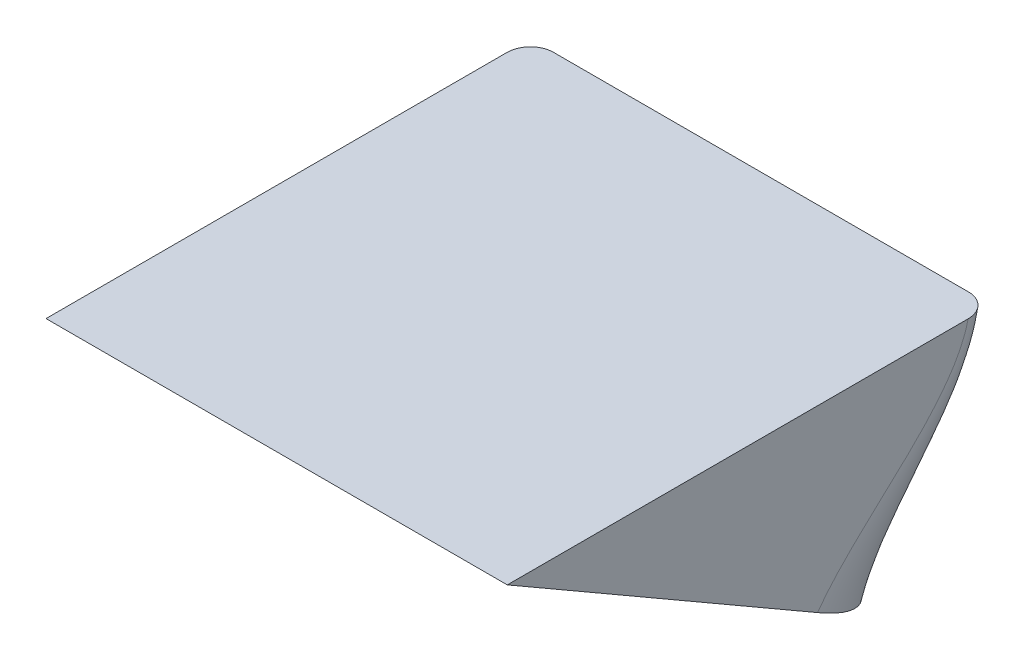
ISO-10303-21;
HEADER;
FILE_DESCRIPTION(('STEP AP214'),'2;1');
FILE_NAME('part.step','',(''),(''),'','','');
FILE_SCHEMA(('AUTOMOTIVE_DESIGN { 1 0 10303 214 1 1 1 1 }'));
ENDSEC;
DATA;
#1=APPLICATION_CONTEXT('core data for automotive mechanical design processes');
#2=APPLICATION_PROTOCOL_DEFINITION('international standard','automotive_design',2000,#1);
#3=PRODUCT_CONTEXT('',#1,'mechanical');
#4=PRODUCT('Part','Part','',(#3));
#5=PRODUCT_RELATED_PRODUCT_CATEGORY('part','',(#4));
#6=PRODUCT_DEFINITION_FORMATION('','',#4);
#7=PRODUCT_DEFINITION_CONTEXT('part definition',#1,'design');
#8=PRODUCT_DEFINITION('design','',#6,#7);
#9=PRODUCT_DEFINITION_SHAPE('','',#8);
#10=(LENGTH_UNIT() NAMED_UNIT(*) SI_UNIT(.MILLI.,.METRE.));
#11=(NAMED_UNIT(*) PLANE_ANGLE_UNIT() SI_UNIT($,.RADIAN.));
#12=(NAMED_UNIT(*) SI_UNIT($,.STERADIAN.) SOLID_ANGLE_UNIT());
#13=UNCERTAINTY_MEASURE_WITH_UNIT(LENGTH_MEASURE(1.E-05),#10,'distance_accuracy_value','');
#14=(GEOMETRIC_REPRESENTATION_CONTEXT(3) GLOBAL_UNCERTAINTY_ASSIGNED_CONTEXT((#13)) GLOBAL_UNIT_ASSIGNED_CONTEXT((#10,
#11,#12)) REPRESENTATION_CONTEXT('',''));
#15=CARTESIAN_POINT('',(0.,0.,0.));
#16=DIRECTION('',(0.,0.,1.));
#17=DIRECTION('',(1.,0.,0.));
#18=AXIS2_PLACEMENT_3D('',#15,#16,#17);
#19=CARTESIAN_POINT('',(-30.,-66.,-31.5));
#20=DIRECTION('',(0.,1.,0.));
#21=DIRECTION('',(0.,0.,1.));
#22=AXIS2_PLACEMENT_3D('',#19,#20,#21);
#23=PLANE('',#22);
#24=DIRECTION('',(1.,0.,0.));
#25=VECTOR('',#24,1.);
#26=CARTESIAN_POINT('',(0.,-66.,-31.5));
#27=LINE('',#26,#25);
#28=CARTESIAN_POINT('',(-27.,-66.,-31.5));
#29=VERTEX_POINT('',#28);
#30=CARTESIAN_POINT('',(27.,-66.,-31.5));
#31=VERTEX_POINT('',#30);
#32=EDGE_CURVE('E183',#29,#31,#27,.T.);
#33=ORIENTED_EDGE('',*,*,#32,.F.);
#34=CARTESIAN_POINT('',(-27.,-66.,-31.5));
#35=CARTESIAN_POINT('',(-27.083409750939,-66.,-31.5000087998473));
#36=CARTESIAN_POINT('',(-27.1668152959624,-66.,-31.4964677986083));
#37=CARTESIAN_POINT('',(-27.333023273883,-66.,-31.4823543059817));
#38=CARTESIAN_POINT('',(-27.4158257515633,-66.,-31.4717823421999));
#39=CARTESIAN_POINT('',(-27.5801533988719,-66.,-31.4436907770837));
#40=CARTESIAN_POINT('',(-27.6616798967303,-66.,-31.4261789800236));
#41=CARTESIAN_POINT('',(-27.8229468520137,-66.,-31.3843598908501));
#42=CARTESIAN_POINT('',(-27.9026873216265,-66.,-31.3600526451244));
#43=CARTESIAN_POINT('',(-28.1384417452151,-66.,-31.2771603859736));
#44=CARTESIAN_POINT('',(-28.2910783274851,-66.,-31.2085894223591));
#45=CARTESIAN_POINT('',(-28.5826621893436,-66.,-31.0469780269951));
#46=CARTESIAN_POINT('',(-28.7216104067731,-66.,-30.9539392732304));
#47=CARTESIAN_POINT('',(-28.982920650389,-66.,-30.7455025844542));
#48=CARTESIAN_POINT('',(-29.1051824382591,-66.,-30.629978839817));
#49=CARTESIAN_POINT('',(-29.3289012549432,-66.,-30.3802792218854));
#50=CARTESIAN_POINT('',(-29.4303547812059,-66.,-30.2461002148109));
#51=CARTESIAN_POINT('',(-29.6111198881664,-66.,-29.9609565623901));
#52=CARTESIAN_POINT('',(-29.6901030535738,-66.,-29.8097839775815));
#53=CARTESIAN_POINT('',(-29.8220827422039,-66.,-29.496502144927));
#54=CARTESIAN_POINT('',(-29.8750847572,-65.9999999999999,-29.3343952165797));
#55=CARTESIAN_POINT('',(-29.942979581329,-65.9999999999999,-29.0498725213845));
#56=CARTESIAN_POINT('',(-29.9643723849996,-66.,-28.9289616645253));
#57=CARTESIAN_POINT('',(-29.9928821201246,-66.,-28.6856615836717));
#58=CARTESIAN_POINT('',(-30.0000216359405,-66.,-28.5632750080659));
#59=CARTESIAN_POINT('',(-30.,-66.,-28.4408525525516));
#60=B_SPLINE_CURVE_WITH_KNOTS('',3,(#34,#35,#36,#37,#38,#39,#40,#41,#42,#43,#44,#45,#46,#47,#48,
#49,#50,#51,#52,#53,#54,#55,#56,#57,#58,#59),.UNSPECIFIED.,.F.,.F.,(4,2,2,2,2,2,2,2,2,2,2,2,4),
(0.,0.250146634642803,0.50027450032079,0.750121876243957,0.999967546684958,1.49938952813993,
1.99877726849431,2.50104400520802,3.00339521672346,3.51275004413754,4.02199716004835,
4.38956480665742,4.75654957791437),.UNSPECIFIED.);
#61=CARTESIAN_POINT('',(-30.,-66.,-28.4408525525516));
#62=VERTEX_POINT('',#61);
#63=EDGE_CURVE('E203',#29,#62,#60,.T.);
#64=ORIENTED_EDGE('',*,*,#63,.T.);
#65=DIRECTION('',(0.,0.,1.));
#66=VECTOR('',#65,1.);
#67=CARTESIAN_POINT('',(-30.,-66.,-31.5));
#68=LINE('',#67,#66);
#69=CARTESIAN_POINT('',(-30.,-66.,31.5));
#70=VERTEX_POINT('',#69);
#71=EDGE_CURVE('E172',#62,#70,#68,.T.);
#72=ORIENTED_EDGE('',*,*,#71,.T.);
#73=DIRECTION('',(1.,0.,0.));
#74=VECTOR('',#73,1.);
#75=CARTESIAN_POINT('',(0.,-66.,31.5));
#76=LINE('',#75,#74);
#77=CARTESIAN_POINT('',(30.,-66.,31.5));
#78=VERTEX_POINT('',#77);
#79=EDGE_CURVE('E186',#70,#78,#76,.T.);
#80=ORIENTED_EDGE('',*,*,#79,.T.);
#81=DIRECTION('',(0.,0.,1.));
#82=VECTOR('',#81,1.);
#83=CARTESIAN_POINT('',(30.,-66.,-31.5));
#84=LINE('',#83,#82);
#85=CARTESIAN_POINT('',(30.,-66.,-28.4408525525511));
#86=VERTEX_POINT('',#85);
#87=EDGE_CURVE('E165',#86,#78,#84,.T.);
#88=ORIENTED_EDGE('',*,*,#87,.F.);
#89=CARTESIAN_POINT('',(30.,-66.000000000002,-28.4408525525511));
#90=CARTESIAN_POINT('',(30.000007531813,-66.0000000000007,-28.5283329955902));
#91=CARTESIAN_POINT('',(29.9963660977423,-66.0000000000002,-28.615812674946));
#92=CARTESIAN_POINT('',(29.9818111411775,-65.9999999999998,-28.7901696416501));
#93=CARTESIAN_POINT('',(29.9708972042897,-65.9999999999999,-28.8770468943866));
#94=CARTESIAN_POINT('',(29.9418216750174,-66.0000000000001,-29.0495964352772));
#95=CARTESIAN_POINT('',(29.9236593770083,-66.,-29.1352686052762));
#96=CARTESIAN_POINT('',(29.8801963874258,-66.,-29.3047546061911));
#97=CARTESIAN_POINT('',(29.8548959757725,-66.,-29.3885685098398));
#98=CARTESIAN_POINT('',(29.768401708112,-66.,-29.6364870416861));
#99=CARTESIAN_POINT('',(29.6966184081053,-66.,-29.7970471838911));
#100=CARTESIAN_POINT('',(29.5267499427174,-66.,-30.1034033545798));
#101=CARTESIAN_POINT('',(29.428677506337,-66.,-30.2492064813567));
#102=CARTESIAN_POINT('',(29.2105914563231,-66.,-30.5196072659805));
#103=CARTESIAN_POINT('',(29.0909477981821,-66.,-30.6445027774188));
#104=CARTESIAN_POINT('',(28.8320125456285,-66.,-30.8720107041019));
#105=CARTESIAN_POINT('',(28.6927171127211,-66.,-30.9746187560675));
#106=CARTESIAN_POINT('',(28.4011715269257,-66.,-31.1527006852311));
#107=CARTESIAN_POINT('',(28.2491961428452,-66.,-31.2286250933951));
#108=CARTESIAN_POINT('',(27.9345922250912,-66.,-31.3534644322736));
#109=CARTESIAN_POINT('',(27.7719726861893,-66.,-31.4024018467737));
#110=CARTESIAN_POINT('',(27.5067582030237,-66.,-31.4580097597986));
#111=CARTESIAN_POINT('',(27.4059775698433,-66.,-31.4737479245535));
#112=CARTESIAN_POINT('',(27.2034802097448,-66.,-31.4947397788626));
#113=CARTESIAN_POINT('',(27.1017650751468,-66.,-31.5000088337571));
#114=CARTESIAN_POINT('',(27.,-66.0000000000001,-31.5));
#115=B_SPLINE_CURVE_WITH_KNOTS('',3,(#89,#90,#91,#92,#93,#94,#95,#96,#97,#98,#99,#100,#101,#102,
#103,#104,#105,#106,#107,#108,#109,#110,#111,#112,#113,#114),.UNSPECIFIED.,.F.,.F.,(4,2,2,2,2,2,
2,2,2,2,2,2,4),(0.,0.26236310731463,0.524741165590485,0.787144772478248,1.04953809067369,
1.57438872597411,2.09898569017098,2.61531912343855,3.13175354984066,3.63899427800126,
4.14581176566762,4.45132173797554,4.75638298613195),.UNSPECIFIED.);
#116=EDGE_CURVE('E11',#86,#31,#115,.T.);
#117=ORIENTED_EDGE('',*,*,#116,.T.);
#118=EDGE_LOOP('',(#33,#64,#72,#80,#88,#117));
#119=FACE_BOUND('',#118,.T.);
#120=ADVANCED_FACE('F44',(#119),#23,.T.);
#121=CARTESIAN_POINT('',(-30.,-66.,-31.5));
#122=DIRECTION('',(0.,-0.173648177666927,-0.984807753012208));
#123=DIRECTION('',(0.,0.984807753012209,-0.173648177666927));
#124=AXIS2_PLACEMENT_3D('',#121,#122,#123);
#125=PLANE('',#124);
#126=DIRECTION('',(1.,0.,0.));
#127=VECTOR('',#126,1.);
#128=CARTESIAN_POINT('',(-30.,-99.0123314089026,-25.6790352765211));
#129=LINE('',#128,#127);
#130=CARTESIAN_POINT('',(-10.,-99.0123314089026,-25.6790352765211));
#131=VERTEX_POINT('',#130);
#132=CARTESIAN_POINT('',(9.99999999999999,-99.0123314089026,-25.6790352765211));
#133=VERTEX_POINT('',#132);
#134=EDGE_CURVE('E180',#131,#133,#129,.T.);
#135=ORIENTED_EDGE('',*,*,#134,.F.);
#136=CARTESIAN_POINT('',(-10.,-165.036994226708,-14.0371058295632));
#137=CARTESIAN_POINT('',(-10.,-143.02877328744,-17.9177489785492));
#138=CARTESIAN_POINT('',(-10.,-121.020552348171,-21.7983921275351));
#139=CARTESIAN_POINT('',(-10.,-99.0123314089027,-25.6790352765211));
#140=CARTESIAN_POINT('',(-10.,-88.0082209392685,-27.6193568510141));
#141=CARTESIAN_POINT('',(-27.,-77.0041104696343,-29.559678425507));
#142=CARTESIAN_POINT('',(-27.,-66.,-31.5));
#143=CARTESIAN_POINT('',(-27.,-43.9917790607316,-35.380643148986));
#144=CARTESIAN_POINT('',(-27.,-21.9835581214632,-39.2612862979719));
#145=CARTESIAN_POINT('',(-27.,0.0246628178052766,-43.1419294469578));
#146=(BOUNDED_CURVE() B_SPLINE_CURVE(3,(#136,#137,#138,#139,#140,#141,#142,#143,#144,#145),
.UNSPECIFIED.,.F.,.F.) B_SPLINE_CURVE_WITH_KNOTS((4,3,3,4),(-0.100564799498974,
-0.0335215998329913,0.,0.0670431996659827),
.UNSPECIFIED.) CURVE() GEOMETRIC_REPRESENTATION_ITEM() RATIONAL_B_SPLINE_CURVE((1.,1.,1.,1.,1.,
1.,1.,1.,1.,1.)) REPRESENTATION_ITEM(''));
#147=EDGE_CURVE('E194',#131,#29,#146,.T.);
#148=ORIENTED_EDGE('',*,*,#147,.T.);
#149=ORIENTED_EDGE('',*,*,#32,.T.);
#150=CARTESIAN_POINT('',(10.,-165.036994226708,-14.0371058295632));
#151=CARTESIAN_POINT('',(10.,-143.02877328744,-17.9177489785492));
#152=CARTESIAN_POINT('',(10.,-121.020552348171,-21.7983921275351));
#153=CARTESIAN_POINT('',(10.,-99.0123314089027,-25.6790352765211));
#154=CARTESIAN_POINT('',(10.,-88.0082209392685,-27.6193568510141));
#155=CARTESIAN_POINT('',(27.,-77.0041104696343,-29.559678425507));
#156=CARTESIAN_POINT('',(27.,-66.,-31.5));
#157=CARTESIAN_POINT('',(27.,-43.9917790607316,-35.380643148986));
#158=CARTESIAN_POINT('',(27.,-21.9835581214632,-39.2612862979719));
#159=CARTESIAN_POINT('',(27.,0.0246628178052766,-43.1419294469578));
#160=(BOUNDED_CURVE() B_SPLINE_CURVE(3,(#150,#151,#152,#153,#154,#155,#156,#157,#158,#159),
.UNSPECIFIED.,.F.,.F.) B_SPLINE_CURVE_WITH_KNOTS((4,3,3,4),(-0.100564799498974,
-0.0335215998329913,0.,0.0670431996659827),
.UNSPECIFIED.) CURVE() GEOMETRIC_REPRESENTATION_ITEM() RATIONAL_B_SPLINE_CURVE((1.,1.,1.,1.,1.,
1.,1.,1.,1.,1.)) REPRESENTATION_ITEM(''));
#161=EDGE_CURVE('E189',#31,#133,#160,.F.);
#162=ORIENTED_EDGE('',*,*,#161,.T.);
#163=EDGE_LOOP('',(#135,#148,#149,#162));
#164=FACE_BOUND('',#163,.T.);
#165=ADVANCED_FACE('F229',(#164),#125,.T.);
#166=CARTESIAN_POINT('',(-30.,-99.0123314089026,-25.6790352765211));
#167=DIRECTION('',(0.,-0.866025403784438,0.500000000000001));
#168=DIRECTION('',(0.,-0.500000000000001,-0.866025403784438));
#169=AXIS2_PLACEMENT_3D('',#166,#167,#168);
#170=PLANE('',#169);
#171=CARTESIAN_POINT('',(0.,-88.5000000000001,-7.47114317029971));
#172=DIRECTION('',(0.,-0.866025403784438,0.500000000000001));
#173=DIRECTION('',(0.,-0.500000000000001,-0.866025403784438));
#174=AXIS2_PLACEMENT_3D('',#171,#172,#173);
#175=CIRCLE('',#174,2.5);
#176=CARTESIAN_POINT('',(0.,-89.7500000000001,-9.63620667976081));
#177=VERTEX_POINT('',#176);
#178=EDGE_CURVE('E128',#177,#177,#175,.T.);
#179=ORIENTED_EDGE('',*,*,#178,.F.);
#180=EDGE_LOOP('',(#179));
#181=FACE_BOUND('',#180,.T.);
#182=CARTESIAN_POINT('',(-20.,-93.5000000000001,-16.1313972081441));
#183=DIRECTION('',(0.,-0.866025403784438,0.500000000000001));
#184=DIRECTION('',(0.,-0.500000000000001,-0.866025403784438));
#185=AXIS2_PLACEMENT_3D('',#182,#183,#184);
#186=CIRCLE('',#185,2.5);
#187=CARTESIAN_POINT('',(-20.,-94.7500000000001,-18.2964607176052));
#188=VERTEX_POINT('',#187);
#189=EDGE_CURVE('E127',#188,#188,#186,.T.);
#190=ORIENTED_EDGE('',*,*,#189,.F.);
#191=EDGE_LOOP('',(#190));
#192=FACE_BOUND('',#191,.T.);
#193=CARTESIAN_POINT('',(20.,-83.5000000000001,1.18911086754467));
#194=DIRECTION('',(0.,-0.866025403784438,0.500000000000001));
#195=DIRECTION('',(0.,-0.500000000000001,-0.866025403784438));
#196=AXIS2_PLACEMENT_3D('',#193,#194,#195);
#197=CIRCLE('',#196,2.5);
#198=CARTESIAN_POINT('',(20.,-84.7500000000001,-0.975952641916426));
#199=VERTEX_POINT('',#198);
#200=EDGE_CURVE('E141',#199,#199,#197,.T.);
#201=ORIENTED_EDGE('',*,*,#200,.F.);
#202=EDGE_LOOP('',(#201));
#203=FACE_BOUND('',#202,.T.);
#204=CARTESIAN_POINT('',(20.,-93.5000000000001,-16.1313972081441));
#205=DIRECTION('',(0.,-0.866025403784438,0.500000000000001));
#206=DIRECTION('',(0.,-0.500000000000001,-0.866025403784438));
#207=AXIS2_PLACEMENT_3D('',#204,#205,#206);
#208=CIRCLE('',#207,2.5);
#209=CARTESIAN_POINT('',(20.,-94.7500000000001,-18.2964607176052));
#210=VERTEX_POINT('',#209);
#211=EDGE_CURVE('E149',#210,#210,#208,.T.);
#212=ORIENTED_EDGE('',*,*,#211,.F.);
#213=EDGE_LOOP('',(#212));
#214=FACE_BOUND('',#213,.T.);
#215=CARTESIAN_POINT('',(-20.,-83.5000000000001,1.18911086754467));
#216=DIRECTION('',(0.,-0.866025403784438,0.500000000000001));
#217=DIRECTION('',(0.,-0.500000000000001,-0.866025403784438));
#218=AXIS2_PLACEMENT_3D('',#215,#216,#217);
#219=CIRCLE('',#218,2.5);
#220=CARTESIAN_POINT('',(-20.,-84.7500000000001,-0.975952641916426));
#221=VERTEX_POINT('',#220);
#222=EDGE_CURVE('E157',#221,#221,#219,.T.);
#223=ORIENTED_EDGE('',*,*,#222,.F.);
#224=EDGE_LOOP('',(#223));
#225=FACE_BOUND('',#224,.T.);
#226=DIRECTION('',(0.,-0.500000000000001,-0.866025403784438));
#227=VECTOR('',#226,1.);
#228=CARTESIAN_POINT('',(-30.,-99.0123314089026,-25.6790352765211));
#229=LINE('',#228,#227);
#230=CARTESIAN_POINT('',(-30.,-89.2962735941893,-8.85032949216093));
#231=VERTEX_POINT('',#230);
#232=EDGE_CURVE('E176',#70,#231,#229,.T.);
#233=ORIENTED_EDGE('',*,*,#232,.T.);
#234=CARTESIAN_POINT('',(-30.,-89.2962735941893,-8.85032949216094));
#235=CARTESIAN_POINT('',(-30.0000114400202,-89.5268732721249,-9.24973985055446));
#236=CARTESIAN_POINT('',(-29.9786646874418,-89.7573498397986,-9.64893697571935));
#237=CARTESIAN_POINT('',(-29.896110913035,-90.2162713670292,-10.4438123775698));
#238=CARTESIAN_POINT('',(-29.8349482235315,-90.4447183000284,-10.8394940723577));
#239=CARTESIAN_POINT('',(-29.6760426448846,-90.897072135473,-11.6229938983465));
#240=CARTESIAN_POINT('',(-29.5785019886132,-91.1209970534688,-12.0108432333958));
#241=CARTESIAN_POINT('',(-29.3494498681219,-91.5644641991147,-12.7789508611422));
#242=CARTESIAN_POINT('',(-29.2179346217302,-91.7840059358804,-13.1592083036022));
#243=CARTESIAN_POINT('',(-28.9196184136407,-92.223251814644,-13.9200044826359));
#244=CARTESIAN_POINT('',(-28.7520027653077,-92.4428171792478,-14.3003028497121));
#245=CARTESIAN_POINT('',(-28.3859954431539,-92.8753958533125,-15.049551091463));
#246=CARTESIAN_POINT('',(-28.1876064427398,-93.0884097300034,-15.418501948609));
#247=CARTESIAN_POINT('',(-27.7616619948126,-93.5075787393188,-16.1445239697014));
#248=CARTESIAN_POINT('',(-27.5340453094967,-93.713718292737,-16.5015681496714));
#249=CARTESIAN_POINT('',(-27.051791580978,-94.1179497815932,-17.2017176263895));
#250=CARTESIAN_POINT('',(-26.7971515341123,-94.3160408190427,-17.5448213677761));
#251=CARTESIAN_POINT('',(-26.2050771357596,-94.7450382214615,-18.2878666650806));
#252=CARTESIAN_POINT('',(-25.8616005375311,-94.9738671274325,-18.6842099564627));
#253=CARTESIAN_POINT('',(-25.1396917556795,-95.4173217747363,-19.4522959364453));
#254=CARTESIAN_POINT('',(-24.7612556609662,-95.6319459222917,-19.8240358645425));
#255=CARTESIAN_POINT('',(-23.9717331483095,-96.0456431848991,-20.5405805423307));
#256=CARTESIAN_POINT('',(-23.5606446769561,-96.2447153203677,-20.8853835953335));
#257=CARTESIAN_POINT('',(-22.708025919608,-96.625879474542,-21.5455792763875));
#258=CARTESIAN_POINT('',(-22.2664957472481,-96.8079715566262,-21.8609720142132));
#259=CARTESIAN_POINT('',(-21.487439016848,-97.1035476662482,-22.3729248535821));
#260=CARTESIAN_POINT('',(-21.156840365532,-97.2216247204251,-22.5774403106247));
#261=CARTESIAN_POINT('',(-20.4823351863955,-97.4479126211424,-22.9693824518051));
#262=CARTESIAN_POINT('',(-20.1384277313305,-97.5561227784719,-23.1568079421948));
#263=CARTESIAN_POINT('',(-19.438299129799,-97.7621153323799,-23.5135975115444));
#264=CARTESIAN_POINT('',(-19.082076987578,-97.8598968830869,-23.6829601254117));
#265=CARTESIAN_POINT('',(-18.3587965315942,-98.0443896664324,-24.0025109997958));
#266=CARTESIAN_POINT('',(-17.9917497960926,-98.1311122344768,-24.1527188938116));
#267=CARTESIAN_POINT('',(-17.2476970549191,-98.2930889806035,-24.4332708477478));
#268=CARTESIAN_POINT('',(-16.8706917471538,-98.3683439598571,-24.5636162953375));
#269=CARTESIAN_POINT('',(-16.1080915495844,-98.5069122862897,-24.8036236770385));
#270=CARTESIAN_POINT('',(-15.722498979797,-98.5702288161433,-24.9132911237039));
#271=CARTESIAN_POINT('',(-15.0452370731078,-98.6696856067046,-25.0855553381139));
#272=CARTESIAN_POINT('',(-14.755191559548,-98.7086126950809,-25.1529790329723));
#273=CARTESIAN_POINT('',(-14.1717907885689,-98.7795758112768,-25.2758907556871));
#274=CARTESIAN_POINT('',(-13.8784361134986,-98.8116130322681,-25.3313808501773));
#275=CARTESIAN_POINT('',(-13.2890477447352,-98.8686865075662,-25.4302350091582));
#276=CARTESIAN_POINT('',(-12.9930143304339,-98.8937234835026,-25.4736003235479));
#277=CARTESIAN_POINT('',(-12.3985221720097,-98.9367411851719,-25.548109168464));
#278=CARTESIAN_POINT('',(-12.100060846233,-98.9547129984137,-25.5792372621028));
#279=CARTESIAN_POINT('',(-11.5017221354603,-98.983494048441,-25.6290875030454));
#280=CARTESIAN_POINT('',(-11.2018445787822,-98.9943023931596,-25.6478081052437));
#281=CARTESIAN_POINT('',(-10.6013119636882,-99.0087242978533,-25.6727875769151));
#282=CARTESIAN_POINT('',(-10.300656706402,-99.0123357869433,-25.6790428595098));
#283=CARTESIAN_POINT('',(-10.,-99.0123314089027,-25.6790352765211));
#284=B_SPLINE_CURVE_WITH_KNOTS('',3,(#234,#235,#236,#237,#238,#239,#240,#241,#242,#243,#244,
#245,#246,#247,#248,#249,#250,#251,#252,#253,#254,#255,#256,#257,#258,#259,#260,#261,#262,#263,
#264,#265,#266,#267,#268,#269,#270,#271,#272,#273,#274,#275,#276,#277,#278,#279,#280,#281,#282,
#283),.UNSPECIFIED.,.F.,.F.,(4,2,2,2,2,2,2,2,2,2,2,2,2,2,2,2,2,2,2,2,2,2,2,2,4),(0.,
1.38274855181617,2.76396013484887,4.13760502781449,5.51140290574979,6.92025275753911,
8.32898028526063,9.74070906623994,11.1525949263979,12.8673879059092,14.5823729605772,
16.2974659510268,18.0125525396075,19.2307576131813,20.4490477142948,21.6674365567307,
22.8845663428483,24.101611056424,25.3183308575471,26.2189570550979,27.1194271584248,
28.0198044013454,28.9213138263401,29.8229354952651,30.7248165671301),.UNSPECIFIED.);
#285=EDGE_CURVE('E237',#231,#131,#284,.T.);
#286=ORIENTED_EDGE('',*,*,#285,.T.);
#287=ORIENTED_EDGE('',*,*,#134,.T.);
#288=CARTESIAN_POINT('',(10.,-99.0123314089027,-25.6790352765211));
#289=CARTESIAN_POINT('',(10.3550956459739,-99.0123400209809,-25.6790501930781));
#290=CARTESIAN_POINT('',(10.7101879059605,-99.0072999393523,-25.6703205156231));
#291=CARTESIAN_POINT('',(11.4191466012209,-98.9871851783056,-25.6354807275081));
#292=CARTESIAN_POINT('',(11.7730133166285,-98.972112968369,-25.6093748941156));
#293=CARTESIAN_POINT('',(12.4784477033206,-98.9319983925233,-25.5398944106268));
#294=CARTESIAN_POINT('',(12.8300155677993,-98.9069568756654,-25.4965212311303));
#295=CARTESIAN_POINT('',(13.5285754620524,-98.8471308442435,-25.3928995050924));
#296=CARTESIAN_POINT('',(13.8755790450439,-98.8123800165086,-25.3327093058505));
#297=CARTESIAN_POINT('',(14.5651890949779,-98.7332670689701,-25.1956816611772));
#298=CARTESIAN_POINT('',(14.907795425475,-98.6889046516819,-25.1188437004875));
#299=CARTESIAN_POINT('',(15.5875657076603,-98.5907924520276,-24.9489083858439));
#300=CARTESIAN_POINT('',(15.9247296738369,-98.5370426946563,-24.8558110751824));
#301=CARTESIAN_POINT('',(16.7613775500542,-98.3909515064455,-24.602773714663));
#302=CARTESIAN_POINT('',(17.2568636745262,-98.2928274137195,-24.4328178006151));
#303=CARTESIAN_POINT('',(18.2304811335739,-98.0769019868064,-24.0588239905557));
#304=CARTESIAN_POINT('',(18.708609026379,-97.959096775929,-23.8547793799196));
#305=CARTESIAN_POINT('',(19.4107646600921,-97.7685247372491,-23.524698926424));
#306=CARTESIAN_POINT('',(19.6423892989312,-97.7026644223866,-23.4106255148796));
#307=CARTESIAN_POINT('',(20.1002448125892,-97.5664968490223,-23.1747763594693));
#308=CARTESIAN_POINT('',(20.3264774707687,-97.4961910897326,-23.053003212315));
#309=CARTESIAN_POINT('',(20.996847113479,-97.2787805943387,-22.676437188194));
#310=CARTESIAN_POINT('',(21.4326482620584,-97.1251846822222,-22.4104012645732));
#311=CARTESIAN_POINT('',(22.3069377139046,-96.7916251886825,-21.8326592744155));
#312=CARTESIAN_POINT('',(22.7438051888314,-96.610602228834,-21.5191183106215));
#313=CARTESIAN_POINT('',(23.5876205581912,-96.2318822510852,-20.8631560673192));
#314=CARTESIAN_POINT('',(23.9945672487768,-96.0341845629721,-20.5207336269685));
#315=CARTESIAN_POINT('',(24.7769905042239,-95.6231690325575,-19.8088338455904));
#316=CARTESIAN_POINT('',(25.1524142463296,-95.4098260514354,-19.4393129628488));
#317=CARTESIAN_POINT('',(25.8687694119612,-94.969134956992,-18.6760135968297));
#318=CARTESIAN_POINT('',(26.2097003596787,-94.7417866505448,-18.2822347790483));
#319=CARTESIAN_POINT('',(26.8784578122951,-94.2570227332125,-17.4425990445526));
#320=CARTESIAN_POINT('',(27.2034597918129,-93.9986264248591,-16.9950435099964));
#321=CARTESIAN_POINT('',(27.6562309706282,-93.6012204033616,-16.3067160895288));
#322=CARTESIAN_POINT('',(27.8013828074226,-93.467098252896,-16.0744097105021));
#323=CARTESIAN_POINT('',(28.0796748078477,-93.1957096206589,-15.6043508108707));
#324=CARTESIAN_POINT('',(28.2128103035577,-93.0584419427043,-15.3665962184164));
#325=CARTESIAN_POINT('',(28.5922765902559,-92.6433969577602,-14.6477172170666));
#326=CARTESIAN_POINT('',(28.8199400822083,-92.3612646608546,-14.1590497443699));
#327=CARTESIAN_POINT('',(29.2202346158809,-91.7873900628869,-13.1650697835168));
#328=CARTESIAN_POINT('',(29.3928607557829,-91.4956469084001,-12.6597558171853));
#329=CARTESIAN_POINT('',(29.6849350711114,-90.8889666942513,-11.6089548623327));
#330=CARTESIAN_POINT('',(29.8010766289137,-90.5736202193319,-11.0627587457846));
#331=CARTESIAN_POINT('',(29.9192319596377,-90.0969340461605,-10.2371140745861));
#332=CARTESIAN_POINT('',(29.9492763229704,-89.9372493159606,-9.96053200868696));
#333=CARTESIAN_POINT('',(29.9896653923046,-89.6171553541692,-9.40611300366824));
#334=CARTESIAN_POINT('',(29.9999969067878,-89.4567457093808,-9.12827534887066));
#335=CARTESIAN_POINT('',(30.,-89.2962735941892,-8.85032949216095));
#336=B_SPLINE_CURVE_WITH_KNOTS('',3,(#288,#289,#290,#291,#292,#293,#294,#295,#296,#297,#298,
#299,#300,#301,#302,#303,#304,#305,#306,#307,#308,#309,#310,#311,#312,#313,#314,#315,#316,#317,
#318,#319,#320,#321,#322,#323,#324,#325,#326,#327,#328,#329,#330,#331,#332,#333,#334,#335),
.UNSPECIFIED.,.F.,.F.,(4,2,2,2,2,2,2,2,2,2,2,2,2,2,2,2,2,2,2,2,2,2,2,4),(0.,1.06513852771662,
2.13001496073302,3.19480072132178,4.25593708735284,5.31710630087803,6.37827268896044,
7.97523351191049,9.57250926806853,10.3717093633708,11.1706413538453,12.7685308936023,
14.4689187614165,16.1693750060652,17.8726260751278,19.5759006363617,21.4048918322833,
22.3196271724578,23.2347163389592,25.0572294009906,26.8799047370677,28.7992654643604,
29.7610711068277,30.7235201485861),.UNSPECIFIED.);
#337=CARTESIAN_POINT('',(30.,-89.2962735941893,-8.85032949216094));
#338=VERTEX_POINT('',#337);
#339=EDGE_CURVE('E75',#133,#338,#336,.T.);
#340=ORIENTED_EDGE('',*,*,#339,.T.);
#341=DIRECTION('',(0.,-0.500000000000001,-0.866025403784438));
#342=VECTOR('',#341,1.);
#343=CARTESIAN_POINT('',(30.,-99.0123314089026,-25.6790352765211));
#344=LINE('',#343,#342);
#345=EDGE_CURVE('E169',#78,#338,#344,.T.);
#346=ORIENTED_EDGE('',*,*,#345,.F.);
#347=ORIENTED_EDGE('',*,*,#79,.F.);
#348=EDGE_LOOP('',(#233,#286,#287,#340,#346,#347));
#349=FACE_BOUND('',#348,.T.);
#350=ADVANCED_FACE('F249',(#181,#192,#203,#214,#225,#349),#170,.T.);
#351=CARTESIAN_POINT('',(-30.,0.,0.));
#352=DIRECTION('',(-1.,0.,0.));
#353=DIRECTION('',(0.,0.,1.));
#354=AXIS2_PLACEMENT_3D('',#351,#352,#353);
#355=PLANE('',#354);
#356=ORIENTED_EDGE('',*,*,#71,.F.);
#357=CARTESIAN_POINT('',(-30.,-161.564030673369,5.65904923068093));
#358=CARTESIAN_POINT('',(-30.,-139.555809734101,1.77840608169498));
#359=CARTESIAN_POINT('',(-30.,-117.547588794833,-2.10223706729096));
#360=CARTESIAN_POINT('',(-30.,-95.5393678555641,-5.98288021627692));
#361=CARTESIAN_POINT('',(-30.,-84.5352573859299,-7.92320179076989));
#362=CARTESIAN_POINT('',(-30.,-76.4831659366335,-26.6052551664704));
#363=CARTESIAN_POINT('',(-30.,-65.4790554669993,-28.5455767409634));
#364=CARTESIAN_POINT('',(-30.,-43.4708345277308,-32.4262198899493));
#365=CARTESIAN_POINT('',(-30.,-21.4626135884624,-36.3068630389353));
#366=CARTESIAN_POINT('',(-30.,0.545607350806059,-40.1875061879212));
#367=(BOUNDED_CURVE() B_SPLINE_CURVE(3,(#357,#358,#359,#360,#361,#362,#363,#364,#365,#366),
.UNSPECIFIED.,.F.,.F.) B_SPLINE_CURVE_WITH_KNOTS((4,3,3,4),(-0.100564799498974,
-0.0335215998329913,0.,0.0670431996659827),
.UNSPECIFIED.) CURVE() GEOMETRIC_REPRESENTATION_ITEM() RATIONAL_B_SPLINE_CURVE((1.,1.,1.,1.,1.,
1.,1.,1.,1.,1.)) REPRESENTATION_ITEM(''));
#368=EDGE_CURVE('E213',#62,#231,#367,.F.);
#369=ORIENTED_EDGE('',*,*,#368,.T.);
#370=ORIENTED_EDGE('',*,*,#232,.F.);
#371=EDGE_LOOP('',(#356,#369,#370));
#372=FACE_BOUND('',#371,.T.);
#373=ADVANCED_FACE('F253',(#372),#355,.T.);
#374=CARTESIAN_POINT('',(30.,0.,0.));
#375=DIRECTION('',(-1.,0.,0.));
#376=DIRECTION('',(0.,0.,1.));
#377=AXIS2_PLACEMENT_3D('',#374,#375,#376);
#378=PLANE('',#377);
#379=ORIENTED_EDGE('',*,*,#345,.T.);
#380=CARTESIAN_POINT('',(30.,-161.564030673369,5.65904923068093));
#381=CARTESIAN_POINT('',(30.,-139.555809734101,1.77840608169498));
#382=CARTESIAN_POINT('',(30.,-117.547588794833,-2.10223706729096));
#383=CARTESIAN_POINT('',(30.,-95.5393678555641,-5.98288021627692));
#384=CARTESIAN_POINT('',(30.,-84.5352573859299,-7.92320179076989));
#385=CARTESIAN_POINT('',(30.,-76.4831659366335,-26.6052551664704));
#386=CARTESIAN_POINT('',(30.,-65.4790554669993,-28.5455767409634));
#387=CARTESIAN_POINT('',(30.,-43.4708345277308,-32.4262198899493));
#388=CARTESIAN_POINT('',(30.,-21.4626135884624,-36.3068630389353));
#389=CARTESIAN_POINT('',(30.,0.545607350806059,-40.1875061879212));
#390=(BOUNDED_CURVE() B_SPLINE_CURVE(3,(#380,#381,#382,#383,#384,#385,#386,#387,#388,#389),
.UNSPECIFIED.,.F.,.F.) B_SPLINE_CURVE_WITH_KNOTS((4,3,3,4),(-0.100564799498974,
-0.0335215998329913,0.,0.0670431996659827),
.UNSPECIFIED.) CURVE() GEOMETRIC_REPRESENTATION_ITEM() RATIONAL_B_SPLINE_CURVE((1.,1.,1.,1.,1.,
1.,1.,1.,1.,1.)) REPRESENTATION_ITEM(''));
#391=EDGE_CURVE('E62',#338,#86,#390,.T.);
#392=ORIENTED_EDGE('',*,*,#391,.T.);
#393=ORIENTED_EDGE('',*,*,#87,.T.);
#394=EDGE_LOOP('',(#379,#392,#393));
#395=FACE_BOUND('',#394,.T.);
#396=ADVANCED_FACE('F258',(#395),#378,.F.);
#397=CARTESIAN_POINT('',(-20.,-74.8397459621557,-3.81088913245534));
#398=DIRECTION('',(0.,-0.866025403784438,0.500000000000001));
#399=DIRECTION('',(0.,-0.500000000000001,-0.866025403784438));
#400=AXIS2_PLACEMENT_3D('',#397,#398,#399);
#401=CONICAL_SURFACE('',#400,2.5,1.02974425867665);
#402=CARTESIAN_POINT('',(-20.,-73.5388445616269,-4.56196490623979));
#403=VERTEX_POINT('',#402);
#404=VERTEX_LOOP('',#403);
#405=FACE_BOUND('',#404,.T.);
#406=CARTESIAN_POINT('',(-20.,-74.8397459621557,-3.81088913245534));
#407=DIRECTION('',(0.,-0.866025403784438,0.500000000000001));
#408=DIRECTION('',(0.,-0.500000000000001,-0.866025403784438));
#409=AXIS2_PLACEMENT_3D('',#406,#407,#408);
#410=CIRCLE('',#409,2.5);
#411=CARTESIAN_POINT('',(-20.,-76.0897459621557,-5.97595264191643));
#412=VERTEX_POINT('',#411);
#413=EDGE_CURVE('E161',#412,#412,#410,.T.);
#414=ORIENTED_EDGE('',*,*,#413,.T.);
#415=EDGE_LOOP('',(#414));
#416=FACE_BOUND('',#415,.T.);
#417=ADVANCED_FACE('F262',(#405,#416),#401,.F.);
#418=CARTESIAN_POINT('',(-20.,-83.5000000000001,1.18911086754467));
#419=DIRECTION('',(0.,-0.866025403784438,0.500000000000001));
#420=DIRECTION('',(0.,-0.500000000000001,-0.866025403784438));
#421=AXIS2_PLACEMENT_3D('',#418,#419,#420);
#422=CYLINDRICAL_SURFACE('',#421,2.5);
#423=ORIENTED_EDGE('',*,*,#413,.F.);
#424=EDGE_LOOP('',(#423));
#425=FACE_BOUND('',#424,.T.);
#426=ORIENTED_EDGE('',*,*,#222,.T.);
#427=EDGE_LOOP('',(#426));
#428=FACE_BOUND('',#427,.T.);
#429=ADVANCED_FACE('F266',(#425,#428),#422,.F.);
#430=CARTESIAN_POINT('',(20.,-84.8397459621557,-21.1313972081441));
#431=DIRECTION('',(0.,-0.866025403784438,0.500000000000001));
#432=DIRECTION('',(0.,-0.500000000000001,-0.866025403784438));
#433=AXIS2_PLACEMENT_3D('',#430,#431,#432);
#434=CONICAL_SURFACE('',#433,2.5,1.02974425867666);
#435=CARTESIAN_POINT('',(20.,-83.5388445616269,-21.8824729819286));
#436=VERTEX_POINT('',#435);
#437=VERTEX_LOOP('',#436);
#438=FACE_BOUND('',#437,.T.);
#439=CARTESIAN_POINT('',(20.,-84.8397459621557,-21.1313972081441));
#440=DIRECTION('',(0.,-0.866025403784438,0.500000000000001));
#441=DIRECTION('',(0.,-0.500000000000001,-0.866025403784438));
#442=AXIS2_PLACEMENT_3D('',#439,#440,#441);
#443=CIRCLE('',#442,2.5);
#444=CARTESIAN_POINT('',(20.,-86.0897459621557,-23.2964607176052));
#445=VERTEX_POINT('',#444);
#446=EDGE_CURVE('E153',#445,#445,#443,.T.);
#447=ORIENTED_EDGE('',*,*,#446,.T.);
#448=EDGE_LOOP('',(#447));
#449=FACE_BOUND('',#448,.T.);
#450=ADVANCED_FACE('F270',(#438,#449),#434,.F.);
#451=CARTESIAN_POINT('',(20.,-93.5000000000001,-16.1313972081441));
#452=DIRECTION('',(0.,-0.866025403784438,0.500000000000001));
#453=DIRECTION('',(0.,-0.500000000000001,-0.866025403784438));
#454=AXIS2_PLACEMENT_3D('',#451,#452,#453);
#455=CYLINDRICAL_SURFACE('',#454,2.5);
#456=ORIENTED_EDGE('',*,*,#446,.F.);
#457=EDGE_LOOP('',(#456));
#458=FACE_BOUND('',#457,.T.);
#459=ORIENTED_EDGE('',*,*,#211,.T.);
#460=EDGE_LOOP('',(#459));
#461=FACE_BOUND('',#460,.T.);
#462=ADVANCED_FACE('F274',(#458,#461),#455,.F.);
#463=CARTESIAN_POINT('',(20.,-74.8397459621557,-3.81088913245534));
#464=DIRECTION('',(0.,-0.866025403784438,0.500000000000001));
#465=DIRECTION('',(0.,-0.500000000000001,-0.866025403784438));
#466=AXIS2_PLACEMENT_3D('',#463,#464,#465);
#467=CONICAL_SURFACE('',#466,2.5,1.02974425867665);
#468=CARTESIAN_POINT('',(20.,-73.5388445616269,-4.56196490623979));
#469=VERTEX_POINT('',#468);
#470=VERTEX_LOOP('',#469);
#471=FACE_BOUND('',#470,.T.);
#472=CARTESIAN_POINT('',(20.,-74.8397459621557,-3.81088913245534));
#473=DIRECTION('',(0.,-0.866025403784438,0.500000000000001));
#474=DIRECTION('',(0.,-0.500000000000001,-0.866025403784438));
#475=AXIS2_PLACEMENT_3D('',#472,#473,#474);
#476=CIRCLE('',#475,2.5);
#477=CARTESIAN_POINT('',(20.,-76.0897459621557,-5.97595264191643));
#478=VERTEX_POINT('',#477);
#479=EDGE_CURVE('E145',#478,#478,#476,.T.);
#480=ORIENTED_EDGE('',*,*,#479,.T.);
#481=EDGE_LOOP('',(#480));
#482=FACE_BOUND('',#481,.T.);
#483=ADVANCED_FACE('F278',(#471,#482),#467,.F.);
#484=CARTESIAN_POINT('',(20.,-83.5000000000001,1.18911086754467));
#485=DIRECTION('',(0.,-0.866025403784438,0.500000000000001));
#486=DIRECTION('',(0.,-0.500000000000001,-0.866025403784438));
#487=AXIS2_PLACEMENT_3D('',#484,#485,#486);
#488=CYLINDRICAL_SURFACE('',#487,2.5);
#489=ORIENTED_EDGE('',*,*,#479,.F.);
#490=EDGE_LOOP('',(#489));
#491=FACE_BOUND('',#490,.T.);
#492=ORIENTED_EDGE('',*,*,#200,.T.);
#493=EDGE_LOOP('',(#492));
#494=FACE_BOUND('',#493,.T.);
#495=ADVANCED_FACE('F282',(#491,#494),#488,.F.);
#496=CARTESIAN_POINT('',(-20.,-84.8397459621557,-21.1313972081441));
#497=DIRECTION('',(0.,-0.866025403784438,0.500000000000001));
#498=DIRECTION('',(0.,-0.500000000000001,-0.866025403784438));
#499=AXIS2_PLACEMENT_3D('',#496,#497,#498);
#500=CONICAL_SURFACE('',#499,2.5,1.02974425867666);
#501=CARTESIAN_POINT('',(-20.,-83.5388445616269,-21.8824729819285));
#502=VERTEX_POINT('',#501);
#503=VERTEX_LOOP('',#502);
#504=FACE_BOUND('',#503,.T.);
#505=CARTESIAN_POINT('',(-20.,-84.8397459621557,-21.1313972081441));
#506=DIRECTION('',(0.,-0.866025403784438,0.500000000000001));
#507=DIRECTION('',(0.,-0.500000000000001,-0.866025403784438));
#508=AXIS2_PLACEMENT_3D('',#505,#506,#507);
#509=CIRCLE('',#508,2.5);
#510=CARTESIAN_POINT('',(-20.,-86.0897459621557,-23.2964607176052));
#511=VERTEX_POINT('',#510);
#512=EDGE_CURVE('E133',#511,#511,#509,.T.);
#513=ORIENTED_EDGE('',*,*,#512,.T.);
#514=EDGE_LOOP('',(#513));
#515=FACE_BOUND('',#514,.T.);
#516=ADVANCED_FACE('F286',(#504,#515),#500,.F.);
#517=CARTESIAN_POINT('',(-20.,-93.5000000000001,-16.1313972081441));
#518=DIRECTION('',(0.,-0.866025403784438,0.500000000000001));
#519=DIRECTION('',(0.,-0.500000000000001,-0.866025403784438));
#520=AXIS2_PLACEMENT_3D('',#517,#518,#519);
#521=CYLINDRICAL_SURFACE('',#520,2.5);
#522=ORIENTED_EDGE('',*,*,#512,.F.);
#523=EDGE_LOOP('',(#522));
#524=FACE_BOUND('',#523,.T.);
#525=ORIENTED_EDGE('',*,*,#189,.T.);
#526=EDGE_LOOP('',(#525));
#527=FACE_BOUND('',#526,.T.);
#528=ADVANCED_FACE('F120',(#524,#527),#521,.F.);
#529=CARTESIAN_POINT('',(0.,-79.8397459621557,-12.4711431702997));
#530=DIRECTION('',(0.,-0.866025403784438,0.500000000000001));
#531=DIRECTION('',(0.,-0.500000000000001,-0.866025403784438));
#532=AXIS2_PLACEMENT_3D('',#529,#530,#531);
#533=CONICAL_SURFACE('',#532,2.5,1.02974425867665);
#534=CARTESIAN_POINT('',(0.,-78.5388445616269,-13.2222189440842));
#535=VERTEX_POINT('',#534);
#536=VERTEX_LOOP('',#535);
#537=FACE_BOUND('',#536,.T.);
#538=CARTESIAN_POINT('',(0.,-79.8397459621557,-12.4711431702997));
#539=DIRECTION('',(0.,-0.866025403784438,0.500000000000001));
#540=DIRECTION('',(0.,-0.500000000000001,-0.866025403784438));
#541=AXIS2_PLACEMENT_3D('',#538,#539,#540);
#542=CIRCLE('',#541,2.5);
#543=CARTESIAN_POINT('',(0.,-81.0897459621557,-14.6362066797608));
#544=VERTEX_POINT('',#543);
#545=EDGE_CURVE('E124',#544,#544,#542,.T.);
#546=ORIENTED_EDGE('',*,*,#545,.T.);
#547=EDGE_LOOP('',(#546));
#548=FACE_BOUND('',#547,.T.);
#549=ADVANCED_FACE('F116',(#537,#548),#533,.F.);
#550=CARTESIAN_POINT('',(0.,-88.5000000000001,-7.47114317029971));
#551=DIRECTION('',(0.,-0.866025403784438,0.500000000000001));
#552=DIRECTION('',(0.,-0.500000000000001,-0.866025403784438));
#553=AXIS2_PLACEMENT_3D('',#550,#551,#552);
#554=CYLINDRICAL_SURFACE('',#553,2.5);
#555=ORIENTED_EDGE('',*,*,#545,.F.);
#556=EDGE_LOOP('',(#555));
#557=FACE_BOUND('',#556,.T.);
#558=ORIENTED_EDGE('',*,*,#178,.T.);
#559=EDGE_LOOP('',(#558));
#560=FACE_BOUND('',#559,.T.);
#561=ADVANCED_FACE('F119',(#557,#560),#554,.F.);
#562=CARTESIAN_POINT('',(-10.,-105.892101274518,-24.4659462281481));
#563=CARTESIAN_POINT('',(-10.,-103.598844652646,-24.8703092442724));
#564=CARTESIAN_POINT('',(-10.,-101.305588030774,-25.2746722603968));
#565=CARTESIAN_POINT('',(-10.,-99.0123314089027,-25.6790352765211));
#566=CARTESIAN_POINT('',(-10.,-88.0082209392685,-27.6193568510141));
#567=CARTESIAN_POINT('',(-27.,-77.0041104696343,-29.559678425507));
#568=CARTESIAN_POINT('',(-27.,-66.,-31.5));
#569=CARTESIAN_POINT('',(-27.,-63.7067433781282,-31.9043630161243));
#570=CARTESIAN_POINT('',(-27.,-61.4134867562565,-32.3087260322487));
#571=CARTESIAN_POINT('',(-27.,-59.1202301343847,-32.713089048373));
#572=CARTESIAN_POINT('',(-30.,-105.892101274518,-24.4659462281481));
#573=CARTESIAN_POINT('',(-30.,-103.598844652646,-24.8703092442724));
#574=CARTESIAN_POINT('',(-30.,-101.305588030774,-25.2746722603968));
#575=CARTESIAN_POINT('',(-30.,-99.0123314089027,-25.6790352765211));
#576=CARTESIAN_POINT('',(-30.,-88.0082209392685,-27.6193568510141));
#577=CARTESIAN_POINT('',(-30.,-77.0041104696343,-29.559678425507));
#578=CARTESIAN_POINT('',(-30.,-66.,-31.5));
#579=CARTESIAN_POINT('',(-30.,-63.7067433781282,-31.9043630161243));
#580=CARTESIAN_POINT('',(-30.,-61.4134867562565,-32.3087260322487));
#581=CARTESIAN_POINT('',(-30.,-59.1202301343847,-32.713089048373));
#582=CARTESIAN_POINT('',(-30.,-102.419137721179,-4.76979116790391));
#583=CARTESIAN_POINT('',(-30.,-100.125881099308,-5.17415418402825));
#584=CARTESIAN_POINT('',(-30.,-97.8326244774359,-5.57851720015258));
#585=CARTESIAN_POINT('',(-30.,-95.5393678555641,-5.98288021627692));
#586=CARTESIAN_POINT('',(-30.,-84.5352573859299,-7.92320179076989));
#587=CARTESIAN_POINT('',(-30.,-76.4831659366335,-26.6052551664704));
#588=CARTESIAN_POINT('',(-30.,-65.4790554669993,-28.5455767409634));
#589=CARTESIAN_POINT('',(-30.,-63.1857988451275,-28.9499397570877));
#590=CARTESIAN_POINT('',(-30.,-60.8925422232557,-29.3543027732121));
#591=CARTESIAN_POINT('',(-30.,-58.5992856013839,-29.7586657893364));
#592=(BOUNDED_SURFACE() B_SPLINE_SURFACE(2,3,((#562,#563,#564,#565,#566,#567,#568,#569,#570,
#571),(#572,#573,#574,#575,#576,#577,#578,#579,#580,#581),(#582,#583,#584,#585,#586,#587,#588,
#589,#590,#591)),.UNSPECIFIED.,.F.,.F.,.F.) B_SPLINE_SURFACE_WITH_KNOTS((3,3),(4,3,3,4),(0.,1.),
(-0.0405075012381867,-0.0335215998329913,0.,0.00698590140519542),
.UNSPECIFIED.) GEOMETRIC_REPRESENTATION_ITEM() RATIONAL_B_SPLINE_SURFACE(((1.,1.,1.,1.,1.,1.,1.,
1.,1.,1.),(0.707106781186548,0.707106781186548,0.707106781186548,0.707106781186548,
0.707106781186548,0.707106781186548,0.707106781186548,0.707106781186548,0.707106781186548,
0.707106781186548),(1.,1.,1.,1.,1.,1.,1.,1.,1.,1.))) REPRESENTATION_ITEM('') SURFACE());
#593=ORIENTED_EDGE('',*,*,#285,.F.);
#594=ORIENTED_EDGE('',*,*,#368,.F.);
#595=ORIENTED_EDGE('',*,*,#63,.F.);
#596=ORIENTED_EDGE('',*,*,#147,.F.);
#597=EDGE_LOOP('',(#593,#594,#595,#596));
#598=FACE_BOUND('',#597,.T.);
#599=ADVANCED_FACE('F221',(#598),#592,.T.);
#600=CARTESIAN_POINT('',(30.,-102.419137721179,-4.76979116790391));
#601=CARTESIAN_POINT('',(30.,-100.125881099308,-5.17415418402824));
#602=CARTESIAN_POINT('',(30.,-97.8326244774359,-5.57851720015258));
#603=CARTESIAN_POINT('',(30.,-95.5393678555641,-5.98288021627692));
#604=CARTESIAN_POINT('',(30.,-84.5352573859299,-7.92320179076989));
#605=CARTESIAN_POINT('',(30.,-76.4831659366335,-26.6052551664704));
#606=CARTESIAN_POINT('',(30.,-65.4790554669993,-28.5455767409634));
#607=CARTESIAN_POINT('',(30.,-63.1857988451275,-28.9499397570877));
#608=CARTESIAN_POINT('',(30.,-60.8925422232557,-29.3543027732121));
#609=CARTESIAN_POINT('',(30.,-58.5992856013839,-29.7586657893364));
#610=CARTESIAN_POINT('',(30.,-105.892101274518,-24.4659462281481));
#611=CARTESIAN_POINT('',(30.,-103.598844652646,-24.8703092442724));
#612=CARTESIAN_POINT('',(30.,-101.305588030774,-25.2746722603967));
#613=CARTESIAN_POINT('',(30.,-99.0123314089027,-25.6790352765211));
#614=CARTESIAN_POINT('',(30.,-88.0082209392685,-27.6193568510141));
#615=CARTESIAN_POINT('',(30.,-77.0041104696343,-29.559678425507));
#616=CARTESIAN_POINT('',(30.,-66.,-31.5));
#617=CARTESIAN_POINT('',(30.,-63.7067433781282,-31.9043630161243));
#618=CARTESIAN_POINT('',(30.,-61.4134867562564,-32.3087260322487));
#619=CARTESIAN_POINT('',(30.,-59.1202301343846,-32.713089048373));
#620=CARTESIAN_POINT('',(10.,-105.892101274518,-24.4659462281481));
#621=CARTESIAN_POINT('',(10.,-103.598844652646,-24.8703092442724));
#622=CARTESIAN_POINT('',(10.,-101.305588030774,-25.2746722603968));
#623=CARTESIAN_POINT('',(10.,-99.0123314089027,-25.6790352765211));
#624=CARTESIAN_POINT('',(10.,-88.0082209392685,-27.6193568510141));
#625=CARTESIAN_POINT('',(27.,-77.0041104696343,-29.559678425507));
#626=CARTESIAN_POINT('',(27.,-66.,-31.5));
#627=CARTESIAN_POINT('',(27.,-63.7067433781282,-31.9043630161243));
#628=CARTESIAN_POINT('',(27.,-61.4134867562564,-32.3087260322487));
#629=CARTESIAN_POINT('',(27.,-59.1202301343847,-32.713089048373));
#630=(BOUNDED_SURFACE() B_SPLINE_SURFACE(2,3,((#600,#601,#602,#603,#604,#605,#606,#607,#608,
#609),(#610,#611,#612,#613,#614,#615,#616,#617,#618,#619),(#620,#621,#622,#623,#624,#625,#626,
#627,#628,#629)),.UNSPECIFIED.,.F.,.F.,.F.) B_SPLINE_SURFACE_WITH_KNOTS((3,3),(4,3,3,4),(0.,1.),
(-0.0405075012381868,-0.0335215998329913,0.,0.00698590140519546),
.UNSPECIFIED.) GEOMETRIC_REPRESENTATION_ITEM() RATIONAL_B_SPLINE_SURFACE(((1.,1.,1.,1.,1.,1.,1.,
1.,1.,1.),(0.707106781186548,0.707106781186548,0.707106781186548,0.707106781186548,
0.707106781186548,0.707106781186548,0.707106781186548,0.707106781186548,0.707106781186548,
0.707106781186548),(1.,1.,1.,1.,1.,1.,1.,1.,1.,1.))) REPRESENTATION_ITEM('') SURFACE());
#631=ORIENTED_EDGE('',*,*,#339,.F.);
#632=ORIENTED_EDGE('',*,*,#161,.F.);
#633=ORIENTED_EDGE('',*,*,#116,.F.);
#634=ORIENTED_EDGE('',*,*,#391,.F.);
#635=EDGE_LOOP('',(#631,#632,#633,#634));
#636=FACE_BOUND('',#635,.T.);
#637=ADVANCED_FACE('F47',(#636),#630,.T.);
#638=CLOSED_SHELL('',(#120,#165,#350,#373,#396,#417,#429,#450,#462,#483,#495,#516,#528,#549,
#561,#599,#637));
#639=MANIFOLD_SOLID_BREP('B2',#638);
#640=ADVANCED_BREP_SHAPE_REPRESENTATION('',(#18,#639),#14);
#641=SHAPE_DEFINITION_REPRESENTATION(#9,#640);
ENDSEC;
END-ISO-10303-21;
